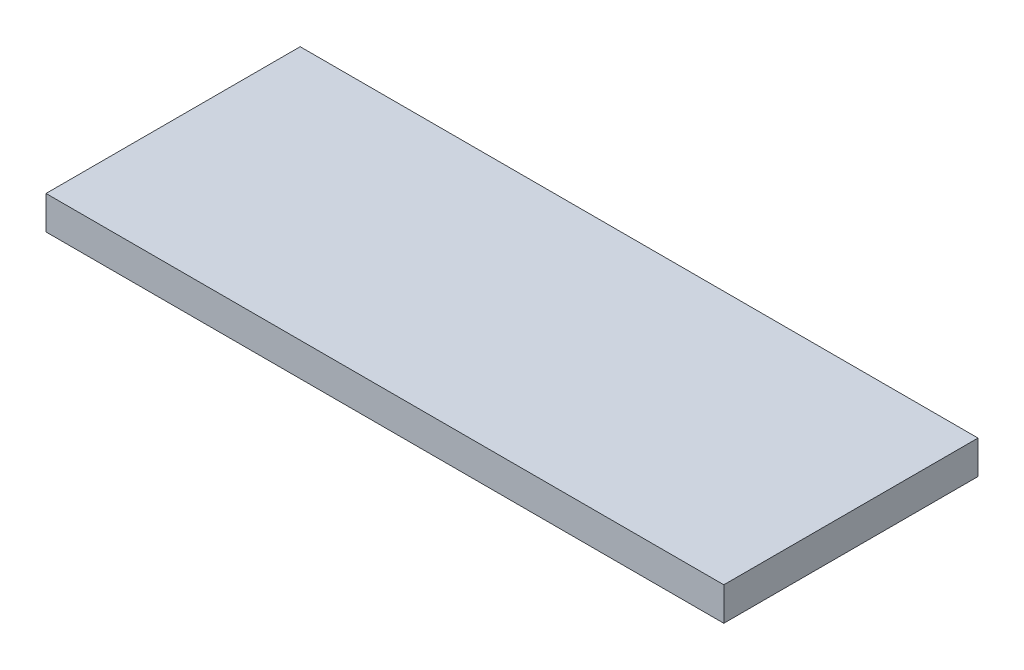
ISO-10303-21;
HEADER;
FILE_DESCRIPTION(('STEP AP214'),'2;1');
FILE_NAME('part.step','',(''),(''),'','','');
FILE_SCHEMA(('AUTOMOTIVE_DESIGN { 1 0 10303 214 1 1 1 1 }'));
ENDSEC;
DATA;
#1=APPLICATION_CONTEXT('core data for automotive mechanical design processes');
#2=APPLICATION_PROTOCOL_DEFINITION('international standard','automotive_design',2000,#1);
#3=PRODUCT_CONTEXT('',#1,'mechanical');
#4=PRODUCT('Part','Part','',(#3));
#5=PRODUCT_RELATED_PRODUCT_CATEGORY('part','',(#4));
#6=PRODUCT_DEFINITION_FORMATION('','',#4);
#7=PRODUCT_DEFINITION_CONTEXT('part definition',#1,'design');
#8=PRODUCT_DEFINITION('design','',#6,#7);
#9=PRODUCT_DEFINITION_SHAPE('','',#8);
#10=(LENGTH_UNIT() NAMED_UNIT(*) SI_UNIT(.MILLI.,.METRE.));
#11=(NAMED_UNIT(*) PLANE_ANGLE_UNIT() SI_UNIT($,.RADIAN.));
#12=(NAMED_UNIT(*) SI_UNIT($,.STERADIAN.) SOLID_ANGLE_UNIT());
#13=UNCERTAINTY_MEASURE_WITH_UNIT(LENGTH_MEASURE(1.E-05),#10,'distance_accuracy_value','');
#14=(GEOMETRIC_REPRESENTATION_CONTEXT(3) GLOBAL_UNCERTAINTY_ASSIGNED_CONTEXT((#13)) GLOBAL_UNIT_ASSIGNED_CONTEXT((#10,
#11,#12)) REPRESENTATION_CONTEXT('',''));
#15=CARTESIAN_POINT('',(0.,0.,0.));
#16=DIRECTION('',(0.,0.,1.));
#17=DIRECTION('',(1.,0.,0.));
#18=AXIS2_PLACEMENT_3D('',#15,#16,#17);
#19=CARTESIAN_POINT('',(0.,20.,0.));
#20=DIRECTION('',(1.,0.,0.));
#21=DIRECTION('',(0.,0.,-1.));
#22=AXIS2_PLACEMENT_3D('',#19,#20,#21);
#23=PLANE('',#22);
#24=DIRECTION('',(0.,0.,1.));
#25=VECTOR('',#24,1.);
#26=CARTESIAN_POINT('',(0.,0.,0.));
#27=LINE('',#26,#25);
#28=CARTESIAN_POINT('',(0.,0.,-152.4));
#29=VERTEX_POINT('',#28);
#30=CARTESIAN_POINT('',(0.,0.,0.));
#31=VERTEX_POINT('',#30);
#32=EDGE_CURVE('E96',#29,#31,#27,.T.);
#33=ORIENTED_EDGE('',*,*,#32,.T.);
#34=DIRECTION('',(0.,-1.,0.));
#35=VECTOR('',#34,1.);
#36=CARTESIAN_POINT('',(0.,20.,0.));
#37=LINE('',#36,#35);
#38=CARTESIAN_POINT('',(0.,20.,0.));
#39=VERTEX_POINT('',#38);
#40=EDGE_CURVE('E11',#39,#31,#37,.T.);
#41=ORIENTED_EDGE('',*,*,#40,.F.);
#42=DIRECTION('',(0.,0.,1.));
#43=VECTOR('',#42,1.);
#44=CARTESIAN_POINT('',(0.,20.,0.));
#45=LINE('',#44,#43);
#46=CARTESIAN_POINT('',(0.,20.,-152.4));
#47=VERTEX_POINT('',#46);
#48=EDGE_CURVE('E84',#47,#39,#45,.T.);
#49=ORIENTED_EDGE('',*,*,#48,.F.);
#50=DIRECTION('',(0.,-1.,0.));
#51=VECTOR('',#50,1.);
#52=CARTESIAN_POINT('',(0.,20.,-152.4));
#53=LINE('',#52,#51);
#54=EDGE_CURVE('E92',#47,#29,#53,.T.);
#55=ORIENTED_EDGE('',*,*,#54,.T.);
#56=EDGE_LOOP('',(#33,#41,#49,#55));
#57=FACE_BOUND('',#56,.T.);
#58=ADVANCED_FACE('F33',(#57),#23,.F.);
#59=CARTESIAN_POINT('',(0.,20.,0.));
#60=DIRECTION('',(0.,0.,-1.));
#61=DIRECTION('',(-1.,0.,0.));
#62=AXIS2_PLACEMENT_3D('',#59,#60,#61);
#63=PLANE('',#62);
#64=DIRECTION('',(1.,0.,0.));
#65=VECTOR('',#64,1.);
#66=CARTESIAN_POINT('',(0.,0.,0.));
#67=LINE('',#66,#65);
#68=CARTESIAN_POINT('',(406.4,0.,0.));
#69=VERTEX_POINT('',#68);
#70=EDGE_CURVE('E88',#31,#69,#67,.T.);
#71=ORIENTED_EDGE('',*,*,#70,.T.);
#72=DIRECTION('',(0.,-1.,0.));
#73=VECTOR('',#72,1.);
#74=CARTESIAN_POINT('',(406.4,20.,0.));
#75=LINE('',#74,#73);
#76=CARTESIAN_POINT('',(406.4,20.,0.));
#77=VERTEX_POINT('',#76);
#78=EDGE_CURVE('E41',#77,#69,#75,.T.);
#79=ORIENTED_EDGE('',*,*,#78,.F.);
#80=DIRECTION('',(1.,0.,0.));
#81=VECTOR('',#80,1.);
#82=CARTESIAN_POINT('',(0.,20.,0.));
#83=LINE('',#82,#81);
#84=EDGE_CURVE('E79',#39,#77,#83,.T.);
#85=ORIENTED_EDGE('',*,*,#84,.F.);
#86=ORIENTED_EDGE('',*,*,#40,.T.);
#87=EDGE_LOOP('',(#71,#79,#85,#86));
#88=FACE_BOUND('',#87,.T.);
#89=ADVANCED_FACE('F87',(#88),#63,.F.);
#90=CARTESIAN_POINT('',(406.4,20.,0.));
#91=DIRECTION('',(-1.,0.,0.));
#92=DIRECTION('',(0.,0.,1.));
#93=AXIS2_PLACEMENT_3D('',#90,#91,#92);
#94=PLANE('',#93);
#95=DIRECTION('',(0.,0.,-1.));
#96=VECTOR('',#95,1.);
#97=CARTESIAN_POINT('',(406.4,0.,0.));
#98=LINE('',#97,#96);
#99=CARTESIAN_POINT('',(406.4,0.,-152.4));
#100=VERTEX_POINT('',#99);
#101=EDGE_CURVE('E66',#69,#100,#98,.T.);
#102=ORIENTED_EDGE('',*,*,#101,.T.);
#103=DIRECTION('',(0.,-1.,0.));
#104=VECTOR('',#103,1.);
#105=CARTESIAN_POINT('',(406.4,20.,-152.4));
#106=LINE('',#105,#104);
#107=CARTESIAN_POINT('',(406.4,20.,-152.4));
#108=VERTEX_POINT('',#107);
#109=EDGE_CURVE('E89',#108,#100,#106,.T.);
#110=ORIENTED_EDGE('',*,*,#109,.F.);
#111=DIRECTION('',(0.,0.,-1.));
#112=VECTOR('',#111,1.);
#113=CARTESIAN_POINT('',(406.4,20.,0.));
#114=LINE('',#113,#112);
#115=EDGE_CURVE('E82',#77,#108,#114,.T.);
#116=ORIENTED_EDGE('',*,*,#115,.F.);
#117=ORIENTED_EDGE('',*,*,#78,.T.);
#118=EDGE_LOOP('',(#102,#110,#116,#117));
#119=FACE_BOUND('',#118,.T.);
#120=ADVANCED_FACE('F90',(#119),#94,.F.);
#121=CARTESIAN_POINT('',(0.,20.,-152.4));
#122=DIRECTION('',(0.,0.,1.));
#123=DIRECTION('',(1.,0.,0.));
#124=AXIS2_PLACEMENT_3D('',#121,#122,#123);
#125=PLANE('',#124);
#126=DIRECTION('',(-1.,0.,0.));
#127=VECTOR('',#126,1.);
#128=CARTESIAN_POINT('',(0.,0.,-152.4));
#129=LINE('',#128,#127);
#130=EDGE_CURVE('E72',#100,#29,#129,.T.);
#131=ORIENTED_EDGE('',*,*,#130,.T.);
#132=ORIENTED_EDGE('',*,*,#54,.F.);
#133=DIRECTION('',(-1.,0.,0.));
#134=VECTOR('',#133,1.);
#135=CARTESIAN_POINT('',(0.,20.,-152.4));
#136=LINE('',#135,#134);
#137=EDGE_CURVE('E49',#108,#47,#136,.T.);
#138=ORIENTED_EDGE('',*,*,#137,.F.);
#139=ORIENTED_EDGE('',*,*,#109,.T.);
#140=EDGE_LOOP('',(#131,#132,#138,#139));
#141=FACE_BOUND('',#140,.T.);
#142=ADVANCED_FACE('F103',(#141),#125,.F.);
#143=CARTESIAN_POINT('',(0.,20.,0.));
#144=DIRECTION('',(0.,-1.,0.));
#145=DIRECTION('',(0.,0.,-1.));
#146=AXIS2_PLACEMENT_3D('',#143,#144,#145);
#147=PLANE('',#146);
#148=ORIENTED_EDGE('',*,*,#48,.T.);
#149=ORIENTED_EDGE('',*,*,#84,.T.);
#150=ORIENTED_EDGE('',*,*,#115,.T.);
#151=ORIENTED_EDGE('',*,*,#137,.T.);
#152=EDGE_LOOP('',(#148,#149,#150,#151));
#153=FACE_BOUND('',#152,.T.);
#154=ADVANCED_FACE('F80',(#153),#147,.F.);
#155=CARTESIAN_POINT('',(0.,0.,0.));
#156=DIRECTION('',(0.,-1.,0.));
#157=DIRECTION('',(0.,0.,-1.));
#158=AXIS2_PLACEMENT_3D('',#155,#156,#157);
#159=PLANE('',#158);
#160=ORIENTED_EDGE('',*,*,#32,.F.);
#161=ORIENTED_EDGE('',*,*,#130,.F.);
#162=ORIENTED_EDGE('',*,*,#101,.F.);
#163=ORIENTED_EDGE('',*,*,#70,.F.);
#164=EDGE_LOOP('',(#160,#161,#162,#163));
#165=FACE_BOUND('',#164,.T.);
#166=ADVANCED_FACE('F106',(#165),#159,.T.);
#167=CLOSED_SHELL('',(#58,#89,#120,#142,#154,#166));
#168=MANIFOLD_SOLID_BREP('B2',#167);
#169=ADVANCED_BREP_SHAPE_REPRESENTATION('',(#18,#168),#14);
#170=SHAPE_DEFINITION_REPRESENTATION(#9,#169);
ENDSEC;
END-ISO-10303-21;
